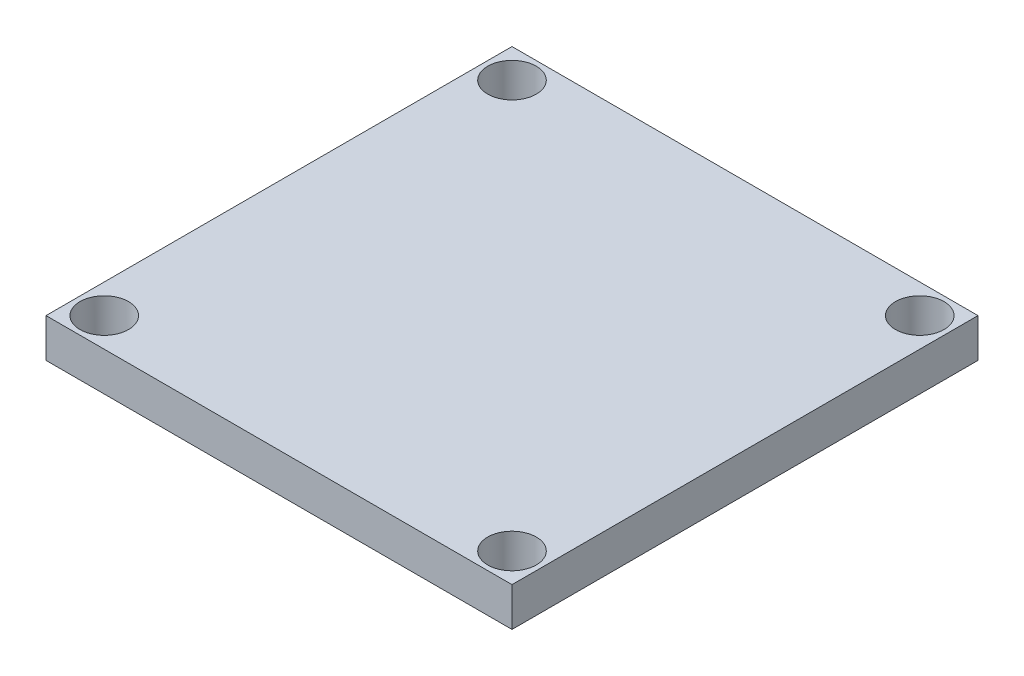
ISO-10303-21;
HEADER;
FILE_DESCRIPTION(('STEP AP214'),'2;1');
FILE_NAME('part.step','',(''),(''),'','','');
FILE_SCHEMA(('AUTOMOTIVE_DESIGN { 1 0 10303 214 1 1 1 1 }'));
ENDSEC;
DATA;
#1=APPLICATION_CONTEXT('core data for automotive mechanical design processes');
#2=APPLICATION_PROTOCOL_DEFINITION('international standard','automotive_design',2000,#1);
#3=PRODUCT_CONTEXT('',#1,'mechanical');
#4=PRODUCT('Part','Part','',(#3));
#5=PRODUCT_RELATED_PRODUCT_CATEGORY('part','',(#4));
#6=PRODUCT_DEFINITION_FORMATION('','',#4);
#7=PRODUCT_DEFINITION_CONTEXT('part definition',#1,'design');
#8=PRODUCT_DEFINITION('design','',#6,#7);
#9=PRODUCT_DEFINITION_SHAPE('','',#8);
#10=(LENGTH_UNIT() NAMED_UNIT(*) SI_UNIT(.MILLI.,.METRE.));
#11=(NAMED_UNIT(*) PLANE_ANGLE_UNIT() SI_UNIT($,.RADIAN.));
#12=(NAMED_UNIT(*) SI_UNIT($,.STERADIAN.) SOLID_ANGLE_UNIT());
#13=UNCERTAINTY_MEASURE_WITH_UNIT(LENGTH_MEASURE(1.E-05),#10,'distance_accuracy_value','');
#14=(GEOMETRIC_REPRESENTATION_CONTEXT(3) GLOBAL_UNCERTAINTY_ASSIGNED_CONTEXT((#13)) GLOBAL_UNIT_ASSIGNED_CONTEXT((#10,
#11,#12)) REPRESENTATION_CONTEXT('',''));
#15=CARTESIAN_POINT('',(0.,0.,0.));
#16=DIRECTION('',(0.,0.,1.));
#17=DIRECTION('',(1.,0.,0.));
#18=AXIS2_PLACEMENT_3D('',#15,#16,#17);
#19=CARTESIAN_POINT('',(-12.,2.,12.));
#20=DIRECTION('',(1.,0.,0.));
#21=DIRECTION('',(0.,0.,-1.));
#22=AXIS2_PLACEMENT_3D('',#19,#20,#21);
#23=PLANE('',#22);
#24=DIRECTION('',(0.,0.,1.));
#25=VECTOR('',#24,1.);
#26=CARTESIAN_POINT('',(-12.,0.,12.));
#27=LINE('',#26,#25);
#28=CARTESIAN_POINT('',(-12.,0.,-12.));
#29=VERTEX_POINT('',#28);
#30=CARTESIAN_POINT('',(-12.,0.,12.));
#31=VERTEX_POINT('',#30);
#32=EDGE_CURVE('E106',#29,#31,#27,.T.);
#33=ORIENTED_EDGE('',*,*,#32,.T.);
#34=DIRECTION('',(0.,-1.,0.));
#35=VECTOR('',#34,1.);
#36=CARTESIAN_POINT('',(-12.,2.,12.));
#37=LINE('',#36,#35);
#38=CARTESIAN_POINT('',(-12.,2.,12.));
#39=VERTEX_POINT('',#38);
#40=EDGE_CURVE('E11',#39,#31,#37,.T.);
#41=ORIENTED_EDGE('',*,*,#40,.F.);
#42=DIRECTION('',(0.,0.,1.));
#43=VECTOR('',#42,1.);
#44=CARTESIAN_POINT('',(-12.,2.,12.));
#45=LINE('',#44,#43);
#46=CARTESIAN_POINT('',(-12.,2.,-12.));
#47=VERTEX_POINT('',#46);
#48=EDGE_CURVE('E90',#47,#39,#45,.T.);
#49=ORIENTED_EDGE('',*,*,#48,.F.);
#50=DIRECTION('',(0.,-1.,0.));
#51=VECTOR('',#50,1.);
#52=CARTESIAN_POINT('',(-12.,2.,-12.));
#53=LINE('',#52,#51);
#54=EDGE_CURVE('E102',#47,#29,#53,.T.);
#55=ORIENTED_EDGE('',*,*,#54,.T.);
#56=EDGE_LOOP('',(#33,#41,#49,#55));
#57=FACE_BOUND('',#56,.T.);
#58=ADVANCED_FACE('F38',(#57),#23,.F.);
#59=CARTESIAN_POINT('',(12.,2.,12.));
#60=DIRECTION('',(0.,0.,-1.));
#61=DIRECTION('',(-1.,0.,0.));
#62=AXIS2_PLACEMENT_3D('',#59,#60,#61);
#63=PLANE('',#62);
#64=DIRECTION('',(1.,0.,0.));
#65=VECTOR('',#64,1.);
#66=CARTESIAN_POINT('',(12.,0.,12.));
#67=LINE('',#66,#65);
#68=CARTESIAN_POINT('',(12.,0.,12.));
#69=VERTEX_POINT('',#68);
#70=EDGE_CURVE('E95',#31,#69,#67,.T.);
#71=ORIENTED_EDGE('',*,*,#70,.T.);
#72=DIRECTION('',(0.,-1.,0.));
#73=VECTOR('',#72,1.);
#74=CARTESIAN_POINT('',(12.,2.,12.));
#75=LINE('',#74,#73);
#76=CARTESIAN_POINT('',(12.,2.,12.));
#77=VERTEX_POINT('',#76);
#78=EDGE_CURVE('E47',#77,#69,#75,.T.);
#79=ORIENTED_EDGE('',*,*,#78,.F.);
#80=DIRECTION('',(1.,0.,0.));
#81=VECTOR('',#80,1.);
#82=CARTESIAN_POINT('',(12.,2.,12.));
#83=LINE('',#82,#81);
#84=EDGE_CURVE('E85',#39,#77,#83,.T.);
#85=ORIENTED_EDGE('',*,*,#84,.F.);
#86=ORIENTED_EDGE('',*,*,#40,.T.);
#87=EDGE_LOOP('',(#71,#79,#85,#86));
#88=FACE_BOUND('',#87,.T.);
#89=ADVANCED_FACE('F94',(#88),#63,.F.);
#90=CARTESIAN_POINT('',(12.,2.,12.));
#91=DIRECTION('',(-1.,0.,0.));
#92=DIRECTION('',(0.,0.,1.));
#93=AXIS2_PLACEMENT_3D('',#90,#91,#92);
#94=PLANE('',#93);
#95=DIRECTION('',(0.,0.,-1.));
#96=VECTOR('',#95,1.);
#97=CARTESIAN_POINT('',(12.,0.,12.));
#98=LINE('',#97,#96);
#99=CARTESIAN_POINT('',(12.,0.,-12.));
#100=VERTEX_POINT('',#99);
#101=EDGE_CURVE('E72',#69,#100,#98,.T.);
#102=ORIENTED_EDGE('',*,*,#101,.T.);
#103=DIRECTION('',(0.,-1.,0.));
#104=VECTOR('',#103,1.);
#105=CARTESIAN_POINT('',(12.,2.,-12.));
#106=LINE('',#105,#104);
#107=CARTESIAN_POINT('',(12.,2.,-12.));
#108=VERTEX_POINT('',#107);
#109=EDGE_CURVE('E97',#108,#100,#106,.T.);
#110=ORIENTED_EDGE('',*,*,#109,.F.);
#111=DIRECTION('',(0.,0.,-1.));
#112=VECTOR('',#111,1.);
#113=CARTESIAN_POINT('',(12.,2.,12.));
#114=LINE('',#113,#112);
#115=EDGE_CURVE('E88',#77,#108,#114,.T.);
#116=ORIENTED_EDGE('',*,*,#115,.F.);
#117=ORIENTED_EDGE('',*,*,#78,.T.);
#118=EDGE_LOOP('',(#102,#110,#116,#117));
#119=FACE_BOUND('',#118,.T.);
#120=ADVANCED_FACE('F98',(#119),#94,.F.);
#121=CARTESIAN_POINT('',(12.,2.,-12.));
#122=DIRECTION('',(0.,0.,1.));
#123=DIRECTION('',(1.,0.,0.));
#124=AXIS2_PLACEMENT_3D('',#121,#122,#123);
#125=PLANE('',#124);
#126=DIRECTION('',(-1.,0.,0.));
#127=VECTOR('',#126,1.);
#128=CARTESIAN_POINT('',(12.,0.,-12.));
#129=LINE('',#128,#127);
#130=EDGE_CURVE('E78',#100,#29,#129,.T.);
#131=ORIENTED_EDGE('',*,*,#130,.T.);
#132=ORIENTED_EDGE('',*,*,#54,.F.);
#133=DIRECTION('',(-1.,0.,0.));
#134=VECTOR('',#133,1.);
#135=CARTESIAN_POINT('',(12.,2.,-12.));
#136=LINE('',#135,#134);
#137=EDGE_CURVE('E55',#108,#47,#136,.T.);
#138=ORIENTED_EDGE('',*,*,#137,.F.);
#139=ORIENTED_EDGE('',*,*,#109,.T.);
#140=EDGE_LOOP('',(#131,#132,#138,#139));
#141=FACE_BOUND('',#140,.T.);
#142=ADVANCED_FACE('F120',(#141),#125,.F.);
#143=CARTESIAN_POINT('',(0.,2.,0.));
#144=DIRECTION('',(0.,1.,0.));
#145=DIRECTION('',(0.,0.,1.));
#146=AXIS2_PLACEMENT_3D('',#143,#144,#145);
#147=PLANE('',#146);
#148=CARTESIAN_POINT('',(-10.5,2.,10.5));
#149=DIRECTION('',(0.,1.,0.));
#150=DIRECTION('',(0.,0.,-1.));
#151=AXIS2_PLACEMENT_3D('',#148,#149,#150);
#152=CIRCLE('',#151,1.25);
#153=CARTESIAN_POINT('',(-10.5,2.,9.25));
#154=VERTEX_POINT('',#153);
#155=EDGE_CURVE('E140',#154,#154,#152,.T.);
#156=ORIENTED_EDGE('',*,*,#155,.F.);
#157=EDGE_LOOP('',(#156));
#158=FACE_BOUND('',#157,.T.);
#159=CARTESIAN_POINT('',(10.4999999999999,2.,10.5000000000001));
#160=DIRECTION('',(0.,1.,0.));
#161=DIRECTION('',(0.,0.,1.));
#162=AXIS2_PLACEMENT_3D('',#159,#160,#161);
#163=CIRCLE('',#162,1.25);
#164=CARTESIAN_POINT('',(10.4999999999999,2.,11.7500000000001));
#165=VERTEX_POINT('',#164);
#166=EDGE_CURVE('E139',#165,#165,#163,.T.);
#167=ORIENTED_EDGE('',*,*,#166,.F.);
#168=EDGE_LOOP('',(#167));
#169=FACE_BOUND('',#168,.T.);
#170=CARTESIAN_POINT('',(10.4999999999999,2.,-10.5000000000001));
#171=DIRECTION('',(0.,1.,0.));
#172=DIRECTION('',(0.,0.,-1.));
#173=AXIS2_PLACEMENT_3D('',#170,#171,#172);
#174=CIRCLE('',#173,1.25);
#175=CARTESIAN_POINT('',(10.4999999999999,2.,-11.7500000000001));
#176=VERTEX_POINT('',#175);
#177=EDGE_CURVE('E148',#176,#176,#174,.T.);
#178=ORIENTED_EDGE('',*,*,#177,.F.);
#179=EDGE_LOOP('',(#178));
#180=FACE_BOUND('',#179,.T.);
#181=CARTESIAN_POINT('',(-10.5,2.,-10.5));
#182=DIRECTION('',(0.,1.,0.));
#183=DIRECTION('',(0.,0.,1.));
#184=AXIS2_PLACEMENT_3D('',#181,#182,#183);
#185=CIRCLE('',#184,1.25);
#186=CARTESIAN_POINT('',(-10.5,2.,-9.25));
#187=VERTEX_POINT('',#186);
#188=EDGE_CURVE('E130',#187,#187,#185,.T.);
#189=ORIENTED_EDGE('',*,*,#188,.F.);
#190=EDGE_LOOP('',(#189));
#191=FACE_BOUND('',#190,.T.);
#192=ORIENTED_EDGE('',*,*,#48,.T.);
#193=ORIENTED_EDGE('',*,*,#84,.T.);
#194=ORIENTED_EDGE('',*,*,#115,.T.);
#195=ORIENTED_EDGE('',*,*,#137,.T.);
#196=EDGE_LOOP('',(#192,#193,#194,#195));
#197=FACE_BOUND('',#196,.T.);
#198=ADVANCED_FACE('F86',(#158,#169,#180,#191,#197),#147,.T.);
#199=CARTESIAN_POINT('',(0.,0.,0.));
#200=DIRECTION('',(0.,1.,0.));
#201=DIRECTION('',(0.,0.,1.));
#202=AXIS2_PLACEMENT_3D('',#199,#200,#201);
#203=PLANE('',#202);
#204=CARTESIAN_POINT('',(-10.5,0.,10.5));
#205=DIRECTION('',(0.,1.,0.));
#206=DIRECTION('',(0.,0.,1.));
#207=AXIS2_PLACEMENT_3D('',#204,#205,#206);
#208=CIRCLE('',#207,1.25);
#209=CARTESIAN_POINT('',(-10.5,0.,11.75));
#210=VERTEX_POINT('',#209);
#211=EDGE_CURVE('E135',#210,#210,#208,.F.);
#212=ORIENTED_EDGE('',*,*,#211,.F.);
#213=EDGE_LOOP('',(#212));
#214=FACE_BOUND('',#213,.T.);
#215=CARTESIAN_POINT('',(10.4999999999999,0.,10.5000000000001));
#216=DIRECTION('',(0.,1.,0.));
#217=DIRECTION('',(0.,0.,1.));
#218=AXIS2_PLACEMENT_3D('',#215,#216,#217);
#219=CIRCLE('',#218,1.25);
#220=CARTESIAN_POINT('',(10.4999999999999,0.,11.7500000000001));
#221=VERTEX_POINT('',#220);
#222=EDGE_CURVE('E144',#221,#221,#219,.F.);
#223=ORIENTED_EDGE('',*,*,#222,.F.);
#224=EDGE_LOOP('',(#223));
#225=FACE_BOUND('',#224,.T.);
#226=CARTESIAN_POINT('',(10.4999999999999,0.,-10.5000000000001));
#227=DIRECTION('',(0.,1.,0.));
#228=DIRECTION('',(0.,0.,1.));
#229=AXIS2_PLACEMENT_3D('',#226,#227,#228);
#230=CIRCLE('',#229,1.25);
#231=CARTESIAN_POINT('',(10.4999999999999,0.,-9.25000000000007));
#232=VERTEX_POINT('',#231);
#233=EDGE_CURVE('E134',#232,#232,#230,.F.);
#234=ORIENTED_EDGE('',*,*,#233,.F.);
#235=EDGE_LOOP('',(#234));
#236=FACE_BOUND('',#235,.T.);
#237=CARTESIAN_POINT('',(-10.5,0.,-10.5));
#238=DIRECTION('',(0.,1.,0.));
#239=DIRECTION('',(0.,0.,1.));
#240=AXIS2_PLACEMENT_3D('',#237,#238,#239);
#241=CIRCLE('',#240,1.25);
#242=CARTESIAN_POINT('',(-10.5,0.,-9.25));
#243=VERTEX_POINT('',#242);
#244=EDGE_CURVE('E110',#243,#243,#241,.F.);
#245=ORIENTED_EDGE('',*,*,#244,.F.);
#246=EDGE_LOOP('',(#245));
#247=FACE_BOUND('',#246,.T.);
#248=ORIENTED_EDGE('',*,*,#32,.F.);
#249=ORIENTED_EDGE('',*,*,#130,.F.);
#250=ORIENTED_EDGE('',*,*,#101,.F.);
#251=ORIENTED_EDGE('',*,*,#70,.F.);
#252=EDGE_LOOP('',(#248,#249,#250,#251));
#253=FACE_BOUND('',#252,.T.);
#254=ADVANCED_FACE('F123',(#214,#225,#236,#247,#253),#203,.F.);
#255=CARTESIAN_POINT('',(-10.5,-3.53553390593274,-10.5));
#256=DIRECTION('',(0.,1.,0.));
#257=DIRECTION('',(0.,0.,1.));
#258=AXIS2_PLACEMENT_3D('',#255,#256,#257);
#259=CYLINDRICAL_SURFACE('',#258,1.25);
#260=ORIENTED_EDGE('',*,*,#244,.T.);
#261=EDGE_LOOP('',(#260));
#262=FACE_BOUND('',#261,.T.);
#263=ORIENTED_EDGE('',*,*,#188,.T.);
#264=EDGE_LOOP('',(#263));
#265=FACE_BOUND('',#264,.T.);
#266=ADVANCED_FACE('F167',(#262,#265),#259,.F.);
#267=CARTESIAN_POINT('',(10.4999999999999,-3.53553390593274,-10.5000000000001));
#268=DIRECTION('',(0.,1.,0.));
#269=DIRECTION('',(0.,0.,1.));
#270=AXIS2_PLACEMENT_3D('',#267,#268,#269);
#271=CYLINDRICAL_SURFACE('',#270,1.25);
#272=ORIENTED_EDGE('',*,*,#233,.T.);
#273=EDGE_LOOP('',(#272));
#274=FACE_BOUND('',#273,.T.);
#275=ORIENTED_EDGE('',*,*,#177,.T.);
#276=EDGE_LOOP('',(#275));
#277=FACE_BOUND('',#276,.T.);
#278=ADVANCED_FACE('F159',(#274,#277),#271,.F.);
#279=CARTESIAN_POINT('',(10.4999999999999,-3.53553390593274,10.5000000000001));
#280=DIRECTION('',(0.,1.,0.));
#281=DIRECTION('',(0.,0.,1.));
#282=AXIS2_PLACEMENT_3D('',#279,#280,#281);
#283=CYLINDRICAL_SURFACE('',#282,1.25);
#284=ORIENTED_EDGE('',*,*,#222,.T.);
#285=EDGE_LOOP('',(#284));
#286=FACE_BOUND('',#285,.T.);
#287=ORIENTED_EDGE('',*,*,#166,.T.);
#288=EDGE_LOOP('',(#287));
#289=FACE_BOUND('',#288,.T.);
#290=ADVANCED_FACE('F175',(#286,#289),#283,.F.);
#291=CARTESIAN_POINT('',(-10.5,-3.53553390593274,10.5));
#292=DIRECTION('',(0.,1.,0.));
#293=DIRECTION('',(0.,0.,1.));
#294=AXIS2_PLACEMENT_3D('',#291,#292,#293);
#295=CYLINDRICAL_SURFACE('',#294,1.25);
#296=ORIENTED_EDGE('',*,*,#211,.T.);
#297=EDGE_LOOP('',(#296));
#298=FACE_BOUND('',#297,.T.);
#299=ORIENTED_EDGE('',*,*,#155,.T.);
#300=EDGE_LOOP('',(#299));
#301=FACE_BOUND('',#300,.T.);
#302=ADVANCED_FACE('F224',(#298,#301),#295,.F.);
#303=CLOSED_SHELL('',(#58,#89,#120,#142,#198,#254,#266,#278,#290,#302));
#304=MANIFOLD_SOLID_BREP('B2',#303);
#305=ADVANCED_BREP_SHAPE_REPRESENTATION('',(#18,#304),#14);
#306=SHAPE_DEFINITION_REPRESENTATION(#9,#305);
ENDSEC;
END-ISO-10303-21;
